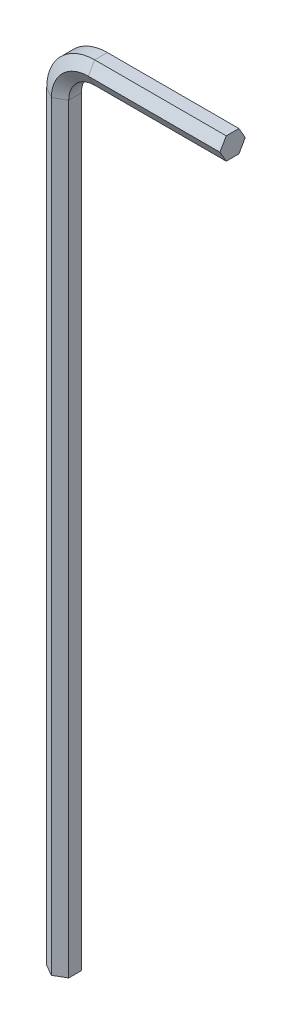
ISO-10303-21;
HEADER;
FILE_DESCRIPTION(('STEP AP214'),'2;1');
FILE_NAME('part.step','',(''),(''),'','','');
FILE_SCHEMA(('AUTOMOTIVE_DESIGN { 1 0 10303 214 1 1 1 1 }'));
ENDSEC;
DATA;
#1=APPLICATION_CONTEXT('core data for automotive mechanical design processes');
#2=APPLICATION_PROTOCOL_DEFINITION('international standard','automotive_design',2000,#1);
#3=PRODUCT_CONTEXT('',#1,'mechanical');
#4=PRODUCT('Part','Part','',(#3));
#5=PRODUCT_RELATED_PRODUCT_CATEGORY('part','',(#4));
#6=PRODUCT_DEFINITION_FORMATION('','',#4);
#7=PRODUCT_DEFINITION_CONTEXT('part definition',#1,'design');
#8=PRODUCT_DEFINITION('design','',#6,#7);
#9=PRODUCT_DEFINITION_SHAPE('','',#8);
#10=(LENGTH_UNIT() NAMED_UNIT(*) SI_UNIT(.MILLI.,.METRE.));
#11=(NAMED_UNIT(*) PLANE_ANGLE_UNIT() SI_UNIT($,.RADIAN.));
#12=(NAMED_UNIT(*) SI_UNIT($,.STERADIAN.) SOLID_ANGLE_UNIT());
#13=UNCERTAINTY_MEASURE_WITH_UNIT(LENGTH_MEASURE(1.E-05),#10,'distance_accuracy_value','');
#14=(GEOMETRIC_REPRESENTATION_CONTEXT(3) GLOBAL_UNCERTAINTY_ASSIGNED_CONTEXT((#13)) GLOBAL_UNIT_ASSIGNED_CONTEXT((#10,
#11,#12)) REPRESENTATION_CONTEXT('',''));
#15=CARTESIAN_POINT('',(0.,0.,0.));
#16=DIRECTION('',(0.,0.,1.));
#17=DIRECTION('',(1.,0.,0.));
#18=AXIS2_PLACEMENT_3D('',#15,#16,#17);
#19=CARTESIAN_POINT('',(4.00000000000003,86.31001,-1.37408209366592));
#20=DIRECTION('',(0.,0.500000000000001,-0.866025403784438));
#21=DIRECTION('',(0.,0.866025403784438,0.500000000000001));
#22=AXIS2_PLACEMENT_3D('',#19,#20,#21);
#23=PLANE('',#22);
#24=DIRECTION('',(0.,0.866025403784438,0.500000000000001));
#25=VECTOR('',#24,1.);
#26=CARTESIAN_POINT('',(4.00000000000003,86.31001,-1.37408209366592));
#27=LINE('',#26,#25);
#28=CARTESIAN_POINT('',(4.00000000000003,86.31001,-1.37408209366592));
#29=VERTEX_POINT('',#28);
#30=CARTESIAN_POINT('',(4.00000000000005,87.5,-0.687041046832959));
#31=VERTEX_POINT('',#30);
#32=EDGE_CURVE('E143',#29,#31,#27,.T.);
#33=ORIENTED_EDGE('',*,*,#32,.T.);
#34=DIRECTION('',(1.,0.,0.));
#35=VECTOR('',#34,1.);
#36=CARTESIAN_POINT('',(4.00000000000005,87.5,-0.687041046832959));
#37=LINE('',#36,#35);
#38=CARTESIAN_POINT('',(18.25001,87.5,-0.687041046832959));
#39=VERTEX_POINT('',#38);
#40=EDGE_CURVE('E23',#31,#39,#37,.T.);
#41=ORIENTED_EDGE('',*,*,#40,.T.);
#42=DIRECTION('',(0.,0.866025403784438,0.500000000000001));
#43=VECTOR('',#42,1.);
#44=CARTESIAN_POINT('',(18.25001,86.31001,-1.37408209366592));
#45=LINE('',#44,#43);
#46=CARTESIAN_POINT('',(18.25001,86.31001,-1.37408209366592));
#47=VERTEX_POINT('',#46);
#48=EDGE_CURVE('E35',#47,#39,#45,.T.);
#49=ORIENTED_EDGE('',*,*,#48,.F.);
#50=DIRECTION('',(1.,0.,0.));
#51=VECTOR('',#50,1.);
#52=CARTESIAN_POINT('',(4.00000000000003,86.31001,-1.37408209366592));
#53=LINE('',#52,#51);
#54=EDGE_CURVE('E10',#29,#47,#53,.T.);
#55=ORIENTED_EDGE('',*,*,#54,.F.);
#56=EDGE_LOOP('',(#33,#41,#49,#55));
#57=FACE_BOUND('',#56,.T.);
#58=ADVANCED_FACE('F15',(#57),#23,.T.);
#59=CARTESIAN_POINT('',(4.00000000000005,87.5,-0.687041046832959));
#60=DIRECTION('',(0.,1.,0.));
#61=DIRECTION('',(0.,0.,1.));
#62=AXIS2_PLACEMENT_3D('',#59,#60,#61);
#63=PLANE('',#62);
#64=DIRECTION('',(0.,0.,1.));
#65=VECTOR('',#64,1.);
#66=CARTESIAN_POINT('',(4.00000000000005,87.5,-0.687041046832959));
#67=LINE('',#66,#65);
#68=CARTESIAN_POINT('',(4.00000000000005,87.5,0.687041046832968));
#69=VERTEX_POINT('',#68);
#70=EDGE_CURVE('E201',#31,#69,#67,.T.);
#71=ORIENTED_EDGE('',*,*,#70,.T.);
#72=DIRECTION('',(1.,0.,0.));
#73=VECTOR('',#72,1.);
#74=CARTESIAN_POINT('',(4.00000000000005,87.5,0.687041046832968));
#75=LINE('',#74,#73);
#76=CARTESIAN_POINT('',(18.25001,87.5,0.687041046832968));
#77=VERTEX_POINT('',#76);
#78=EDGE_CURVE('E253',#69,#77,#75,.T.);
#79=ORIENTED_EDGE('',*,*,#78,.T.);
#80=DIRECTION('',(0.,0.,1.));
#81=VECTOR('',#80,1.);
#82=CARTESIAN_POINT('',(18.25001,87.5,-0.687041046832959));
#83=LINE('',#82,#81);
#84=EDGE_CURVE('E45',#39,#77,#83,.T.);
#85=ORIENTED_EDGE('',*,*,#84,.F.);
#86=ORIENTED_EDGE('',*,*,#40,.F.);
#87=EDGE_LOOP('',(#71,#79,#85,#86));
#88=FACE_BOUND('',#87,.T.);
#89=ADVANCED_FACE('F258',(#88),#63,.T.);
#90=CARTESIAN_POINT('',(4.00000000000005,87.5,0.687041046832968));
#91=DIRECTION('',(0.,0.499999999999995,0.866025403784441));
#92=DIRECTION('',(0.,-0.866025403784442,0.499999999999995));
#93=AXIS2_PLACEMENT_3D('',#90,#91,#92);
#94=PLANE('',#93);
#95=DIRECTION('',(0.,-0.866025403784442,0.499999999999995));
#96=VECTOR('',#95,1.);
#97=CARTESIAN_POINT('',(4.00000000000005,87.5,0.687041046832968));
#98=LINE('',#97,#96);
#99=CARTESIAN_POINT('',(4.00000000000003,86.31001,1.37408209366592));
#100=VERTEX_POINT('',#99);
#101=EDGE_CURVE('E197',#69,#100,#98,.T.);
#102=ORIENTED_EDGE('',*,*,#101,.T.);
#103=DIRECTION('',(1.,0.,0.));
#104=VECTOR('',#103,1.);
#105=CARTESIAN_POINT('',(4.00000000000003,86.31001,1.37408209366592));
#106=LINE('',#105,#104);
#107=CARTESIAN_POINT('',(18.25001,86.31001,1.37408209366592));
#108=VERTEX_POINT('',#107);
#109=EDGE_CURVE('E249',#100,#108,#106,.T.);
#110=ORIENTED_EDGE('',*,*,#109,.T.);
#111=DIRECTION('',(0.,-0.866025403784442,0.499999999999995));
#112=VECTOR('',#111,1.);
#113=CARTESIAN_POINT('',(18.25001,87.5,0.687041046832968));
#114=LINE('',#113,#112);
#115=EDGE_CURVE('E233',#77,#108,#114,.T.);
#116=ORIENTED_EDGE('',*,*,#115,.F.);
#117=ORIENTED_EDGE('',*,*,#78,.F.);
#118=EDGE_LOOP('',(#102,#110,#116,#117));
#119=FACE_BOUND('',#118,.T.);
#120=ADVANCED_FACE('F339',(#119),#94,.T.);
#121=CARTESIAN_POINT('',(4.00000000000003,86.31001,1.37408209366592));
#122=DIRECTION('',(0.,-0.500000000000007,0.866025403784435));
#123=DIRECTION('',(0.,-0.866025403784435,-0.500000000000007));
#124=AXIS2_PLACEMENT_3D('',#121,#122,#123);
#125=PLANE('',#124);
#126=DIRECTION('',(0.,-0.866025403784435,-0.500000000000007));
#127=VECTOR('',#126,1.);
#128=CARTESIAN_POINT('',(4.00000000000003,86.31001,1.37408209366592));
#129=LINE('',#128,#127);
#130=CARTESIAN_POINT('',(4.00000000000002,85.12002,0.687041046832951));
#131=VERTEX_POINT('',#130);
#132=EDGE_CURVE('E193',#100,#131,#129,.T.);
#133=ORIENTED_EDGE('',*,*,#132,.T.);
#134=DIRECTION('',(1.,0.,0.));
#135=VECTOR('',#134,1.);
#136=CARTESIAN_POINT('',(4.00000000000002,85.12002,0.687041046832951));
#137=LINE('',#136,#135);
#138=CARTESIAN_POINT('',(18.25001,85.12002,0.687041046832951));
#139=VERTEX_POINT('',#138);
#140=EDGE_CURVE('E245',#131,#139,#137,.T.);
#141=ORIENTED_EDGE('',*,*,#140,.T.);
#142=DIRECTION('',(0.,-0.866025403784435,-0.500000000000007));
#143=VECTOR('',#142,1.);
#144=CARTESIAN_POINT('',(18.25001,86.31001,1.37408209366592));
#145=LINE('',#144,#143);
#146=EDGE_CURVE('E229',#108,#139,#145,.T.);
#147=ORIENTED_EDGE('',*,*,#146,.F.);
#148=ORIENTED_EDGE('',*,*,#109,.F.);
#149=EDGE_LOOP('',(#133,#141,#147,#148));
#150=FACE_BOUND('',#149,.T.);
#151=ADVANCED_FACE('F338',(#150),#125,.T.);
#152=CARTESIAN_POINT('',(4.00000000000002,85.12002,0.687041046832951));
#153=DIRECTION('',(0.,-1.,0.));
#154=DIRECTION('',(0.,0.,-1.));
#155=AXIS2_PLACEMENT_3D('',#152,#153,#154);
#156=PLANE('',#155);
#157=DIRECTION('',(0.,0.,-1.));
#158=VECTOR('',#157,1.);
#159=CARTESIAN_POINT('',(4.00000000000002,85.12002,0.687041046832951));
#160=LINE('',#159,#158);
#161=CARTESIAN_POINT('',(4.00000000000002,85.12002,-0.687041046832976));
#162=VERTEX_POINT('',#161);
#163=EDGE_CURVE('E184',#131,#162,#160,.T.);
#164=ORIENTED_EDGE('',*,*,#163,.T.);
#165=DIRECTION('',(1.,0.,0.));
#166=VECTOR('',#165,1.);
#167=CARTESIAN_POINT('',(4.00000000000002,85.12002,-0.687041046832976));
#168=LINE('',#167,#166);
#169=CARTESIAN_POINT('',(18.25001,85.12002,-0.687041046832976));
#170=VERTEX_POINT('',#169);
#171=EDGE_CURVE('E241',#162,#170,#168,.T.);
#172=ORIENTED_EDGE('',*,*,#171,.T.);
#173=DIRECTION('',(0.,0.,-1.));
#174=VECTOR('',#173,1.);
#175=CARTESIAN_POINT('',(18.25001,85.12002,0.687041046832951));
#176=LINE('',#175,#174);
#177=EDGE_CURVE('E225',#139,#170,#176,.T.);
#178=ORIENTED_EDGE('',*,*,#177,.F.);
#179=ORIENTED_EDGE('',*,*,#140,.F.);
#180=EDGE_LOOP('',(#164,#172,#178,#179));
#181=FACE_BOUND('',#180,.T.);
#182=ADVANCED_FACE('F345',(#181),#156,.T.);
#183=CARTESIAN_POINT('',(4.00000000000002,85.12002,-0.687041046832976));
#184=DIRECTION('',(0.,-0.499999999999995,-0.866025403784441));
#185=DIRECTION('',(0.,0.866025403784442,-0.499999999999995));
#186=AXIS2_PLACEMENT_3D('',#183,#184,#185);
#187=PLANE('',#186);
#188=DIRECTION('',(0.,0.866025403784442,-0.499999999999995));
#189=VECTOR('',#188,1.);
#190=CARTESIAN_POINT('',(4.00000000000002,85.12002,-0.687041046832976));
#191=LINE('',#190,#189);
#192=EDGE_CURVE('E177',#162,#29,#191,.T.);
#193=ORIENTED_EDGE('',*,*,#192,.T.);
#194=ORIENTED_EDGE('',*,*,#54,.T.);
#195=DIRECTION('',(0.,0.866025403784442,-0.499999999999995));
#196=VECTOR('',#195,1.);
#197=CARTESIAN_POINT('',(18.25001,85.12002,-0.687041046832976));
#198=LINE('',#197,#196);
#199=EDGE_CURVE('E147',#170,#47,#198,.T.);
#200=ORIENTED_EDGE('',*,*,#199,.F.);
#201=ORIENTED_EDGE('',*,*,#171,.F.);
#202=EDGE_LOOP('',(#193,#194,#200,#201));
#203=FACE_BOUND('',#202,.T.);
#204=ADVANCED_FACE('F343',(#203),#187,.T.);
#205=CARTESIAN_POINT('',(4.,82.31001,-1.37408209366592));
#206=DIRECTION('',(0.,0.,1.));
#207=DIRECTION('',(1.,0.,0.));
#208=AXIS2_PLACEMENT_3D('',#205,#206,#207);
#209=CONICAL_SURFACE('',#208,4.,1.0471975511966);
#210=DIRECTION('',(-0.866025403784438,0.,0.500000000000001));
#211=VECTOR('',#210,1.);
#212=CARTESIAN_POINT('',(0.,82.31001,-1.37408209366592));
#213=LINE('',#212,#211);
#214=CARTESIAN_POINT('',(0.,82.31001,-1.37408209366592));
#215=VERTEX_POINT('',#214);
#216=CARTESIAN_POINT('',(-1.18999,82.31001,-0.687041046832959));
#217=VERTEX_POINT('',#216);
#218=EDGE_CURVE('E140',#215,#217,#213,.T.);
#219=ORIENTED_EDGE('',*,*,#218,.T.);
#220=CARTESIAN_POINT('',(4.,82.31001,-0.687041046832959));
#221=DIRECTION('',(0.,0.,-1.));
#222=DIRECTION('',(-1.,0.,0.));
#223=AXIS2_PLACEMENT_3D('',#220,#221,#222);
#224=CIRCLE('',#223,5.18999);
#225=EDGE_CURVE('E148',#217,#31,#224,.T.);
#226=ORIENTED_EDGE('',*,*,#225,.T.);
#227=ORIENTED_EDGE('',*,*,#32,.F.);
#228=CARTESIAN_POINT('',(4.,82.31001,-1.37408209366592));
#229=DIRECTION('',(0.,0.,-1.));
#230=DIRECTION('',(-1.,0.,0.));
#231=AXIS2_PLACEMENT_3D('',#228,#229,#230);
#232=CIRCLE('',#231,4.);
#233=EDGE_CURVE('E135',#215,#29,#232,.T.);
#234=ORIENTED_EDGE('',*,*,#233,.F.);
#235=EDGE_LOOP('',(#219,#226,#227,#234));
#236=FACE_BOUND('',#235,.T.);
#237=ADVANCED_FACE('F137',(#236),#209,.T.);
#238=CARTESIAN_POINT('',(4.,82.31001,0.));
#239=DIRECTION('',(0.,0.,-1.));
#240=DIRECTION('',(-1.,0.,0.));
#241=AXIS2_PLACEMENT_3D('',#238,#239,#240);
#242=CYLINDRICAL_SURFACE('',#241,5.18999);
#243=DIRECTION('',(0.,0.,1.));
#244=VECTOR('',#243,1.);
#245=CARTESIAN_POINT('',(-1.18999,82.31001,-0.687041046832959));
#246=LINE('',#245,#244);
#247=CARTESIAN_POINT('',(-1.18999,82.31001,0.687041046832968));
#248=VERTEX_POINT('',#247);
#249=EDGE_CURVE('E171',#217,#248,#246,.T.);
#250=ORIENTED_EDGE('',*,*,#249,.T.);
#251=CARTESIAN_POINT('',(4.,82.31001,0.687041046832968));
#252=DIRECTION('',(0.,0.,-1.));
#253=DIRECTION('',(-1.,0.,0.));
#254=AXIS2_PLACEMENT_3D('',#251,#252,#253);
#255=CIRCLE('',#254,5.18999);
#256=EDGE_CURVE('E217',#248,#69,#255,.T.);
#257=ORIENTED_EDGE('',*,*,#256,.T.);
#258=ORIENTED_EDGE('',*,*,#70,.F.);
#259=ORIENTED_EDGE('',*,*,#225,.F.);
#260=EDGE_LOOP('',(#250,#257,#258,#259));
#261=FACE_BOUND('',#260,.T.);
#262=ADVANCED_FACE('F267',(#261),#242,.T.);
#263=CARTESIAN_POINT('',(4.,82.31001,0.687041046832968));
#264=DIRECTION('',(0.,0.,-1.));
#265=DIRECTION('',(-1.,0.,0.));
#266=AXIS2_PLACEMENT_3D('',#263,#264,#265);
#267=CONICAL_SURFACE('',#266,5.18999,1.0471975511966);
#268=DIRECTION('',(0.866025403784442,0.,0.499999999999995));
#269=VECTOR('',#268,1.);
#270=CARTESIAN_POINT('',(-1.18999,82.31001,0.687041046832968));
#271=LINE('',#270,#269);
#272=CARTESIAN_POINT('',(0.,82.31001,1.37408209366592));
#273=VERTEX_POINT('',#272);
#274=EDGE_CURVE('E271',#248,#273,#271,.T.);
#275=ORIENTED_EDGE('',*,*,#274,.T.);
#276=CARTESIAN_POINT('',(4.,82.31001,1.37408209366592));
#277=DIRECTION('',(0.,0.,-1.));
#278=DIRECTION('',(-1.,0.,0.));
#279=AXIS2_PLACEMENT_3D('',#276,#277,#278);
#280=CIRCLE('',#279,3.99999999999999);
#281=EDGE_CURVE('E213',#273,#100,#280,.T.);
#282=ORIENTED_EDGE('',*,*,#281,.T.);
#283=ORIENTED_EDGE('',*,*,#101,.F.);
#284=ORIENTED_EDGE('',*,*,#256,.F.);
#285=EDGE_LOOP('',(#275,#282,#283,#284));
#286=FACE_BOUND('',#285,.T.);
#287=ADVANCED_FACE('F263',(#286),#267,.T.);
#288=CARTESIAN_POINT('',(4.,82.31001,1.37408209366592));
#289=DIRECTION('',(0.,0.,1.));
#290=DIRECTION('',(1.,0.,0.));
#291=AXIS2_PLACEMENT_3D('',#288,#289,#290);
#292=CONICAL_SURFACE('',#291,3.99999999999999,1.04719755119659);
#293=DIRECTION('',(0.866025403784435,0.,-0.500000000000007));
#294=VECTOR('',#293,1.);
#295=CARTESIAN_POINT('',(0.,82.31001,1.37408209366592));
#296=LINE('',#295,#294);
#297=CARTESIAN_POINT('',(1.18999000000001,82.31001,0.687041046832951));
#298=VERTEX_POINT('',#297);
#299=EDGE_CURVE('E287',#273,#298,#296,.T.);
#300=ORIENTED_EDGE('',*,*,#299,.T.);
#301=CARTESIAN_POINT('',(4.,82.31001,0.687041046832951));
#302=DIRECTION('',(0.,0.,-1.));
#303=DIRECTION('',(-1.,0.,0.));
#304=AXIS2_PLACEMENT_3D('',#301,#302,#303);
#305=CIRCLE('',#304,2.81000999999999);
#306=EDGE_CURVE('E209',#298,#131,#305,.T.);
#307=ORIENTED_EDGE('',*,*,#306,.T.);
#308=ORIENTED_EDGE('',*,*,#132,.F.);
#309=ORIENTED_EDGE('',*,*,#281,.F.);
#310=EDGE_LOOP('',(#300,#307,#308,#309));
#311=FACE_BOUND('',#310,.T.);
#312=ADVANCED_FACE('F336',(#311),#292,.F.);
#313=CARTESIAN_POINT('',(4.,82.31001,0.));
#314=DIRECTION('',(0.,0.,-1.));
#315=DIRECTION('',(-1.,0.,0.));
#316=AXIS2_PLACEMENT_3D('',#313,#314,#315);
#317=CYLINDRICAL_SURFACE('',#316,2.81001);
#318=DIRECTION('',(0.,0.,-1.));
#319=VECTOR('',#318,1.);
#320=CARTESIAN_POINT('',(1.18999000000001,82.31001,0.687041046832951));
#321=LINE('',#320,#319);
#322=CARTESIAN_POINT('',(1.18998999999999,82.31001,-0.687041046832976));
#323=VERTEX_POINT('',#322);
#324=EDGE_CURVE('E292',#298,#323,#321,.T.);
#325=ORIENTED_EDGE('',*,*,#324,.T.);
#326=CARTESIAN_POINT('',(4.,82.31001,-0.687041046832976));
#327=DIRECTION('',(0.,0.,-1.));
#328=DIRECTION('',(-1.,0.,0.));
#329=AXIS2_PLACEMENT_3D('',#326,#327,#328);
#330=CIRCLE('',#329,2.81001000000001);
#331=EDGE_CURVE('E154',#323,#162,#330,.T.);
#332=ORIENTED_EDGE('',*,*,#331,.T.);
#333=ORIENTED_EDGE('',*,*,#163,.F.);
#334=ORIENTED_EDGE('',*,*,#306,.F.);
#335=EDGE_LOOP('',(#325,#332,#333,#334));
#336=FACE_BOUND('',#335,.T.);
#337=ADVANCED_FACE('F333',(#336),#317,.F.);
#338=CARTESIAN_POINT('',(4.,82.31001,-0.687041046832976));
#339=DIRECTION('',(0.,0.,-1.));
#340=DIRECTION('',(-1.,0.,0.));
#341=AXIS2_PLACEMENT_3D('',#338,#339,#340);
#342=CONICAL_SURFACE('',#341,2.81001000000001,1.0471975511966);
#343=DIRECTION('',(-0.866025403784442,0.,-0.499999999999995));
#344=VECTOR('',#343,1.);
#345=CARTESIAN_POINT('',(1.18998999999999,82.31001,-0.687041046832976));
#346=LINE('',#345,#344);
#347=EDGE_CURVE('E151',#323,#215,#346,.T.);
#348=ORIENTED_EDGE('',*,*,#347,.T.);
#349=ORIENTED_EDGE('',*,*,#233,.T.);
#350=ORIENTED_EDGE('',*,*,#192,.F.);
#351=ORIENTED_EDGE('',*,*,#331,.F.);
#352=EDGE_LOOP('',(#348,#349,#350,#351));
#353=FACE_BOUND('',#352,.T.);
#354=ADVANCED_FACE('F152',(#353),#342,.F.);
#355=CARTESIAN_POINT('',(1.18998999999999,82.31001,-0.687041046832976));
#356=DIRECTION('',(-0.499999999999995,0.,0.866025403784441));
#357=DIRECTION('',(0.866025403784442,0.,0.499999999999995));
#358=AXIS2_PLACEMENT_3D('',#355,#356,#357);
#359=PLANE('',#358);
#360=DIRECTION('',(-0.866025403784442,0.,-0.499999999999995));
#361=VECTOR('',#360,1.);
#362=CARTESIAN_POINT('',(1.18998999999999,0.,-0.687041046832976));
#363=LINE('',#362,#361);
#364=CARTESIAN_POINT('',(1.18998999999999,0.,-0.687041046832976));
#365=VERTEX_POINT('',#364);
#366=CARTESIAN_POINT('',(0.,0.,-1.37408209366592));
#367=VERTEX_POINT('',#366);
#368=EDGE_CURVE('E175',#365,#367,#363,.T.);
#369=ORIENTED_EDGE('',*,*,#368,.T.);
#370=DIRECTION('',(0.,-1.,0.));
#371=VECTOR('',#370,1.);
#372=CARTESIAN_POINT('',(0.,82.31001,-1.37408209366592));
#373=LINE('',#372,#371);
#374=EDGE_CURVE('E165',#215,#367,#373,.T.);
#375=ORIENTED_EDGE('',*,*,#374,.F.);
#376=ORIENTED_EDGE('',*,*,#347,.F.);
#377=DIRECTION('',(0.,-1.,0.));
#378=VECTOR('',#377,1.);
#379=CARTESIAN_POINT('',(1.18998999999999,82.31001,-0.687041046832976));
#380=LINE('',#379,#378);
#381=EDGE_CURVE('E297',#323,#365,#380,.T.);
#382=ORIENTED_EDGE('',*,*,#381,.T.);
#383=EDGE_LOOP('',(#369,#375,#376,#382));
#384=FACE_BOUND('',#383,.T.);
#385=ADVANCED_FACE('F173',(#384),#359,.F.);
#386=CARTESIAN_POINT('',(0.,82.31001,-1.37408209366592));
#387=DIRECTION('',(0.500000000000001,0.,0.866025403784438));
#388=DIRECTION('',(0.866025403784438,0.,-0.500000000000001));
#389=AXIS2_PLACEMENT_3D('',#386,#387,#388);
#390=PLANE('',#389);
#391=DIRECTION('',(-0.866025403784438,0.,0.500000000000001));
#392=VECTOR('',#391,1.);
#393=CARTESIAN_POINT('',(0.,0.,-1.37408209366592));
#394=LINE('',#393,#392);
#395=CARTESIAN_POINT('',(-1.18999,0.,-0.687041046832959));
#396=VERTEX_POINT('',#395);
#397=EDGE_CURVE('E300',#367,#396,#394,.T.);
#398=ORIENTED_EDGE('',*,*,#397,.T.);
#399=DIRECTION('',(0.,-1.,0.));
#400=VECTOR('',#399,1.);
#401=CARTESIAN_POINT('',(-1.18999,82.31001,-0.687041046832959));
#402=LINE('',#401,#400);
#403=EDGE_CURVE('E168',#217,#396,#402,.T.);
#404=ORIENTED_EDGE('',*,*,#403,.F.);
#405=ORIENTED_EDGE('',*,*,#218,.F.);
#406=ORIENTED_EDGE('',*,*,#374,.T.);
#407=EDGE_LOOP('',(#398,#404,#405,#406));
#408=FACE_BOUND('',#407,.T.);
#409=ADVANCED_FACE('F164',(#408),#390,.F.);
#410=CARTESIAN_POINT('',(-1.18999,82.31001,-0.687041046832959));
#411=DIRECTION('',(1.,0.,0.));
#412=DIRECTION('',(0.,0.,-1.));
#413=AXIS2_PLACEMENT_3D('',#410,#411,#412);
#414=PLANE('',#413);
#415=DIRECTION('',(0.,0.,1.));
#416=VECTOR('',#415,1.);
#417=CARTESIAN_POINT('',(-1.18999,0.,-0.687041046832959));
#418=LINE('',#417,#416);
#419=CARTESIAN_POINT('',(-1.18999,0.,0.687041046832968));
#420=VERTEX_POINT('',#419);
#421=EDGE_CURVE('E277',#396,#420,#418,.T.);
#422=ORIENTED_EDGE('',*,*,#421,.T.);
#423=DIRECTION('',(0.,-1.,0.));
#424=VECTOR('',#423,1.);
#425=CARTESIAN_POINT('',(-1.18999,82.31001,0.687041046832968));
#426=LINE('',#425,#424);
#427=EDGE_CURVE('E186',#248,#420,#426,.T.);
#428=ORIENTED_EDGE('',*,*,#427,.F.);
#429=ORIENTED_EDGE('',*,*,#249,.F.);
#430=ORIENTED_EDGE('',*,*,#403,.T.);
#431=EDGE_LOOP('',(#422,#428,#429,#430));
#432=FACE_BOUND('',#431,.T.);
#433=ADVANCED_FACE('F275',(#432),#414,.F.);
#434=CARTESIAN_POINT('',(-1.18999,82.31001,0.687041046832968));
#435=DIRECTION('',(0.499999999999995,0.,-0.866025403784441));
#436=DIRECTION('',(-0.866025403784442,0.,-0.499999999999995));
#437=AXIS2_PLACEMENT_3D('',#434,#435,#436);
#438=PLANE('',#437);
#439=DIRECTION('',(0.866025403784442,0.,0.499999999999995));
#440=VECTOR('',#439,1.);
#441=CARTESIAN_POINT('',(-1.18999,0.,0.687041046832968));
#442=LINE('',#441,#440);
#443=CARTESIAN_POINT('',(0.,0.,1.37408209366592));
#444=VERTEX_POINT('',#443);
#445=EDGE_CURVE('E305',#420,#444,#442,.T.);
#446=ORIENTED_EDGE('',*,*,#445,.T.);
#447=DIRECTION('',(0.,-1.,0.));
#448=VECTOR('',#447,1.);
#449=CARTESIAN_POINT('',(0.,82.31001,1.37408209366592));
#450=LINE('',#449,#448);
#451=EDGE_CURVE('E281',#273,#444,#450,.T.);
#452=ORIENTED_EDGE('',*,*,#451,.F.);
#453=ORIENTED_EDGE('',*,*,#274,.F.);
#454=ORIENTED_EDGE('',*,*,#427,.T.);
#455=EDGE_LOOP('',(#446,#452,#453,#454));
#456=FACE_BOUND('',#455,.T.);
#457=ADVANCED_FACE('F283',(#456),#438,.F.);
#458=CARTESIAN_POINT('',(0.,82.31001,1.37408209366592));
#459=DIRECTION('',(-0.500000000000007,0.,-0.866025403784434));
#460=DIRECTION('',(-0.866025403784435,0.,0.500000000000007));
#461=AXIS2_PLACEMENT_3D('',#458,#459,#460);
#462=PLANE('',#461);
#463=DIRECTION('',(0.866025403784435,0.,-0.500000000000007));
#464=VECTOR('',#463,1.);
#465=CARTESIAN_POINT('',(0.,0.,1.37408209366592));
#466=LINE('',#465,#464);
#467=CARTESIAN_POINT('',(1.18999000000001,0.,0.687041046832951));
#468=VERTEX_POINT('',#467);
#469=EDGE_CURVE('E308',#444,#468,#466,.T.);
#470=ORIENTED_EDGE('',*,*,#469,.T.);
#471=DIRECTION('',(0.,-1.,0.));
#472=VECTOR('',#471,1.);
#473=CARTESIAN_POINT('',(1.18999000000001,82.31001,0.687041046832951));
#474=LINE('',#473,#472);
#475=EDGE_CURVE('E315',#298,#468,#474,.T.);
#476=ORIENTED_EDGE('',*,*,#475,.F.);
#477=ORIENTED_EDGE('',*,*,#299,.F.);
#478=ORIENTED_EDGE('',*,*,#451,.T.);
#479=EDGE_LOOP('',(#470,#476,#477,#478));
#480=FACE_BOUND('',#479,.T.);
#481=ADVANCED_FACE('F323',(#480),#462,.F.);
#482=CARTESIAN_POINT('',(1.18999000000001,82.31001,0.687041046832951));
#483=DIRECTION('',(-1.,0.,0.));
#484=DIRECTION('',(0.,0.,1.));
#485=AXIS2_PLACEMENT_3D('',#482,#483,#484);
#486=PLANE('',#485);
#487=DIRECTION('',(0.,0.,-1.));
#488=VECTOR('',#487,1.);
#489=CARTESIAN_POINT('',(1.18999000000001,0.,0.687041046832951));
#490=LINE('',#489,#488);
#491=EDGE_CURVE('E160',#468,#365,#490,.T.);
#492=ORIENTED_EDGE('',*,*,#491,.T.);
#493=ORIENTED_EDGE('',*,*,#381,.F.);
#494=ORIENTED_EDGE('',*,*,#324,.F.);
#495=ORIENTED_EDGE('',*,*,#475,.T.);
#496=EDGE_LOOP('',(#492,#493,#494,#495));
#497=FACE_BOUND('',#496,.T.);
#498=ADVANCED_FACE('F330',(#497),#486,.F.);
#499=CARTESIAN_POINT('',(18.25001,86.31001,0.));
#500=DIRECTION('',(1.,0.,0.));
#501=DIRECTION('',(0.,0.,1.));
#502=AXIS2_PLACEMENT_3D('',#499,#500,#501);
#503=PLANE('',#502);
#504=ORIENTED_EDGE('',*,*,#199,.T.);
#505=ORIENTED_EDGE('',*,*,#48,.T.);
#506=ORIENTED_EDGE('',*,*,#84,.T.);
#507=ORIENTED_EDGE('',*,*,#115,.T.);
#508=ORIENTED_EDGE('',*,*,#146,.T.);
#509=ORIENTED_EDGE('',*,*,#177,.T.);
#510=EDGE_LOOP('',(#504,#505,#506,#507,#508,#509));
#511=FACE_BOUND('',#510,.T.);
#512=ADVANCED_FACE('F341',(#511),#503,.T.);
#513=CARTESIAN_POINT('',(0.,0.,0.));
#514=DIRECTION('',(0.,1.,0.));
#515=DIRECTION('',(0.,0.,1.));
#516=AXIS2_PLACEMENT_3D('',#513,#514,#515);
#517=PLANE('',#516);
#518=ORIENTED_EDGE('',*,*,#368,.F.);
#519=ORIENTED_EDGE('',*,*,#491,.F.);
#520=ORIENTED_EDGE('',*,*,#469,.F.);
#521=ORIENTED_EDGE('',*,*,#445,.F.);
#522=ORIENTED_EDGE('',*,*,#421,.F.);
#523=ORIENTED_EDGE('',*,*,#397,.F.);
#524=EDGE_LOOP('',(#518,#519,#520,#521,#522,#523));
#525=FACE_BOUND('',#524,.T.);
#526=ADVANCED_FACE('F327',(#525),#517,.F.);
#527=CLOSED_SHELL('',(#58,#89,#120,#151,#182,#204,#237,#262,#287,#312,#337,#354,#385,#409,#433,
#457,#481,#498,#512,#526));
#528=MANIFOLD_SOLID_BREP('B1',#527);
#529=ADVANCED_BREP_SHAPE_REPRESENTATION('',(#18,#528),#14);
#530=SHAPE_DEFINITION_REPRESENTATION(#9,#529);
ENDSEC;
END-ISO-10303-21;
